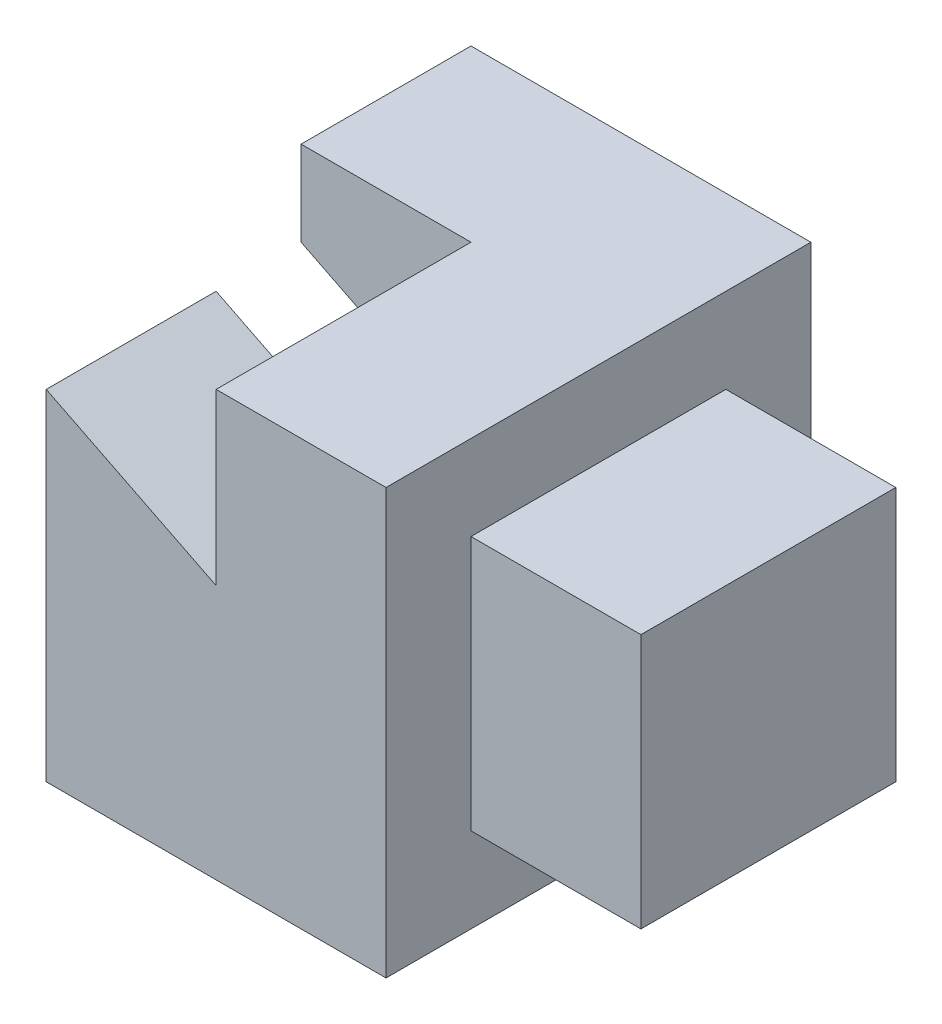
ISO-10303-21;
HEADER;
FILE_DESCRIPTION(('STEP AP214'),'2;1');
FILE_NAME('part.step','',(''),(''),'','','');
FILE_SCHEMA(('AUTOMOTIVE_DESIGN { 1 0 10303 214 1 1 1 1 }'));
ENDSEC;
DATA;
#1=APPLICATION_CONTEXT('core data for automotive mechanical design processes');
#2=APPLICATION_PROTOCOL_DEFINITION('international standard','automotive_design',2000,#1);
#3=PRODUCT_CONTEXT('',#1,'mechanical');
#4=PRODUCT('Part','Part','',(#3));
#5=PRODUCT_RELATED_PRODUCT_CATEGORY('part','',(#4));
#6=PRODUCT_DEFINITION_FORMATION('','',#4);
#7=PRODUCT_DEFINITION_CONTEXT('part definition',#1,'design');
#8=PRODUCT_DEFINITION('design','',#6,#7);
#9=PRODUCT_DEFINITION_SHAPE('','',#8);
#10=(LENGTH_UNIT() NAMED_UNIT(*) SI_UNIT(.MILLI.,.METRE.));
#11=(NAMED_UNIT(*) PLANE_ANGLE_UNIT() SI_UNIT($,.RADIAN.));
#12=(NAMED_UNIT(*) SI_UNIT($,.STERADIAN.) SOLID_ANGLE_UNIT());
#13=UNCERTAINTY_MEASURE_WITH_UNIT(LENGTH_MEASURE(1.E-05),#10,'distance_accuracy_value','');
#14=(GEOMETRIC_REPRESENTATION_CONTEXT(3) GLOBAL_UNCERTAINTY_ASSIGNED_CONTEXT((#13)) GLOBAL_UNIT_ASSIGNED_CONTEXT((#10,
#11,#12)) REPRESENTATION_CONTEXT('',''));
#15=CARTESIAN_POINT('',(0.,0.,0.));
#16=DIRECTION('',(0.,0.,1.));
#17=DIRECTION('',(1.,0.,0.));
#18=AXIS2_PLACEMENT_3D('',#15,#16,#17);
#19=CARTESIAN_POINT('',(2.,-1.5,-1.5));
#20=DIRECTION('',(0.,0.,1.));
#21=DIRECTION('',(1.,0.,0.));
#22=AXIS2_PLACEMENT_3D('',#19,#20,#21);
#23=PLANE('',#22);
#24=DIRECTION('',(0.,1.,0.));
#25=VECTOR('',#24,1.);
#26=CARTESIAN_POINT('',(0.,-1.5,-1.5));
#27=LINE('',#26,#25);
#28=CARTESIAN_POINT('',(0.,-1.5,-1.5));
#29=VERTEX_POINT('',#28);
#30=CARTESIAN_POINT('',(0.,1.5,-1.5));
#31=VERTEX_POINT('',#30);
#32=EDGE_CURVE('E236',#29,#31,#27,.T.);
#33=ORIENTED_EDGE('',*,*,#32,.T.);
#34=DIRECTION('',(-1.,0.,0.));
#35=VECTOR('',#34,1.);
#36=CARTESIAN_POINT('',(2.,1.5,-1.5));
#37=LINE('',#36,#35);
#38=CARTESIAN_POINT('',(2.,1.5,-1.5));
#39=VERTEX_POINT('',#38);
#40=EDGE_CURVE('E11',#39,#31,#37,.T.);
#41=ORIENTED_EDGE('',*,*,#40,.F.);
#42=DIRECTION('',(0.,1.,0.));
#43=VECTOR('',#42,1.);
#44=CARTESIAN_POINT('',(2.,-1.5,-1.5));
#45=LINE('',#44,#43);
#46=CARTESIAN_POINT('',(2.,-1.5,-1.5));
#47=VERTEX_POINT('',#46);
#48=EDGE_CURVE('E237',#47,#39,#45,.T.);
#49=ORIENTED_EDGE('',*,*,#48,.F.);
#50=DIRECTION('',(-1.,0.,0.));
#51=VECTOR('',#50,1.);
#52=CARTESIAN_POINT('',(2.,-1.5,-1.5));
#53=LINE('',#52,#51);
#54=EDGE_CURVE('E247',#47,#29,#53,.T.);
#55=ORIENTED_EDGE('',*,*,#54,.T.);
#56=EDGE_LOOP('',(#33,#41,#49,#55));
#57=FACE_BOUND('',#56,.T.);
#58=ADVANCED_FACE('F33',(#57),#23,.F.);
#59=CARTESIAN_POINT('',(2.,1.5,1.5));
#60=DIRECTION('',(0.,-1.,0.));
#61=DIRECTION('',(0.,0.,-1.));
#62=AXIS2_PLACEMENT_3D('',#59,#60,#61);
#63=PLANE('',#62);
#64=DIRECTION('',(0.,0.,1.));
#65=VECTOR('',#64,1.);
#66=CARTESIAN_POINT('',(0.,1.5,1.5));
#67=LINE('',#66,#65);
#68=CARTESIAN_POINT('',(0.,1.5,1.5));
#69=VERTEX_POINT('',#68);
#70=EDGE_CURVE('E250',#31,#69,#67,.T.);
#71=ORIENTED_EDGE('',*,*,#70,.T.);
#72=DIRECTION('',(-1.,0.,0.));
#73=VECTOR('',#72,1.);
#74=CARTESIAN_POINT('',(2.,1.5,1.5));
#75=LINE('',#74,#73);
#76=CARTESIAN_POINT('',(2.,1.5,1.5));
#77=VERTEX_POINT('',#76);
#78=EDGE_CURVE('E41',#77,#69,#75,.T.);
#79=ORIENTED_EDGE('',*,*,#78,.F.);
#80=DIRECTION('',(0.,0.,1.));
#81=VECTOR('',#80,1.);
#82=CARTESIAN_POINT('',(2.,1.5,1.5));
#83=LINE('',#82,#81);
#84=EDGE_CURVE('E240',#39,#77,#83,.T.);
#85=ORIENTED_EDGE('',*,*,#84,.F.);
#86=ORIENTED_EDGE('',*,*,#40,.T.);
#87=EDGE_LOOP('',(#71,#79,#85,#86));
#88=FACE_BOUND('',#87,.T.);
#89=ADVANCED_FACE('F270',(#88),#63,.F.);
#90=CARTESIAN_POINT('',(2.,-1.5,1.5));
#91=DIRECTION('',(0.,0.,-1.));
#92=DIRECTION('',(-1.,0.,0.));
#93=AXIS2_PLACEMENT_3D('',#90,#91,#92);
#94=PLANE('',#93);
#95=DIRECTION('',(0.,-1.,0.));
#96=VECTOR('',#95,1.);
#97=CARTESIAN_POINT('',(0.,-1.5,1.5));
#98=LINE('',#97,#96);
#99=CARTESIAN_POINT('',(0.,-1.5,1.5));
#100=VERTEX_POINT('',#99);
#101=EDGE_CURVE('E253',#69,#100,#98,.T.);
#102=ORIENTED_EDGE('',*,*,#101,.T.);
#103=DIRECTION('',(-1.,0.,0.));
#104=VECTOR('',#103,1.);
#105=CARTESIAN_POINT('',(2.,-1.5,1.5));
#106=LINE('',#105,#104);
#107=CARTESIAN_POINT('',(2.,-1.5,1.5));
#108=VERTEX_POINT('',#107);
#109=EDGE_CURVE('E260',#108,#100,#106,.T.);
#110=ORIENTED_EDGE('',*,*,#109,.F.);
#111=DIRECTION('',(0.,-1.,0.));
#112=VECTOR('',#111,1.);
#113=CARTESIAN_POINT('',(2.,-1.5,1.5));
#114=LINE('',#113,#112);
#115=EDGE_CURVE('E243',#77,#108,#114,.T.);
#116=ORIENTED_EDGE('',*,*,#115,.F.);
#117=ORIENTED_EDGE('',*,*,#78,.T.);
#118=EDGE_LOOP('',(#102,#110,#116,#117));
#119=FACE_BOUND('',#118,.T.);
#120=ADVANCED_FACE('F267',(#119),#94,.F.);
#121=CARTESIAN_POINT('',(2.,-1.5,1.5));
#122=DIRECTION('',(0.,1.,0.));
#123=DIRECTION('',(0.,0.,1.));
#124=AXIS2_PLACEMENT_3D('',#121,#122,#123);
#125=PLANE('',#124);
#126=DIRECTION('',(0.,0.,-1.));
#127=VECTOR('',#126,1.);
#128=CARTESIAN_POINT('',(0.,-1.5,1.5));
#129=LINE('',#128,#127);
#130=EDGE_CURVE('E241',#100,#29,#129,.T.);
#131=ORIENTED_EDGE('',*,*,#130,.T.);
#132=ORIENTED_EDGE('',*,*,#54,.F.);
#133=DIRECTION('',(0.,0.,-1.));
#134=VECTOR('',#133,1.);
#135=CARTESIAN_POINT('',(2.,-1.5,1.5));
#136=LINE('',#135,#134);
#137=EDGE_CURVE('E245',#108,#47,#136,.T.);
#138=ORIENTED_EDGE('',*,*,#137,.F.);
#139=ORIENTED_EDGE('',*,*,#109,.T.);
#140=EDGE_LOOP('',(#131,#132,#138,#139));
#141=FACE_BOUND('',#140,.T.);
#142=ADVANCED_FACE('F276',(#141),#125,.F.);
#143=CARTESIAN_POINT('',(2.,0.,0.));
#144=DIRECTION('',(-1.,0.,0.));
#145=DIRECTION('',(0.,0.,1.));
#146=AXIS2_PLACEMENT_3D('',#143,#144,#145);
#147=PLANE('',#146);
#148=ORIENTED_EDGE('',*,*,#48,.T.);
#149=ORIENTED_EDGE('',*,*,#84,.T.);
#150=ORIENTED_EDGE('',*,*,#115,.T.);
#151=ORIENTED_EDGE('',*,*,#137,.T.);
#152=EDGE_LOOP('',(#148,#149,#150,#151));
#153=FACE_BOUND('',#152,.T.);
#154=ADVANCED_FACE('F281',(#153),#147,.F.);
#155=CARTESIAN_POINT('',(0.,0.,0.));
#156=DIRECTION('',(1.,0.,0.));
#157=DIRECTION('',(0.,0.,-1.));
#158=AXIS2_PLACEMENT_3D('',#155,#156,#157);
#159=PLANE('',#158);
#160=DIRECTION('',(0.,1.,0.));
#161=VECTOR('',#160,1.);
#162=CARTESIAN_POINT('',(0.,-2.5,2.5));
#163=LINE('',#162,#161);
#164=CARTESIAN_POINT('',(0.,-2.5,2.5));
#165=VERTEX_POINT('',#164);
#166=CARTESIAN_POINT('',(0.,2.5,2.5));
#167=VERTEX_POINT('',#166);
#168=EDGE_CURVE('E180',#165,#167,#163,.T.);
#169=ORIENTED_EDGE('',*,*,#168,.F.);
#170=DIRECTION('',(0.,0.,1.));
#171=VECTOR('',#170,1.);
#172=CARTESIAN_POINT('',(0.,-2.5,-2.5));
#173=LINE('',#172,#171);
#174=CARTESIAN_POINT('',(0.,-2.5,-2.5));
#175=VERTEX_POINT('',#174);
#176=EDGE_CURVE('E227',#175,#165,#173,.T.);
#177=ORIENTED_EDGE('',*,*,#176,.F.);
#178=DIRECTION('',(0.,-1.,0.));
#179=VECTOR('',#178,1.);
#180=CARTESIAN_POINT('',(0.,-2.5,-2.5));
#181=LINE('',#180,#179);
#182=CARTESIAN_POINT('',(0.,2.5,-2.5));
#183=VERTEX_POINT('',#182);
#184=EDGE_CURVE('E225',#183,#175,#181,.T.);
#185=ORIENTED_EDGE('',*,*,#184,.F.);
#186=DIRECTION('',(0.,0.,-1.));
#187=VECTOR('',#186,1.);
#188=CARTESIAN_POINT('',(0.,2.5,-2.5));
#189=LINE('',#188,#187);
#190=EDGE_CURVE('E223',#167,#183,#189,.T.);
#191=ORIENTED_EDGE('',*,*,#190,.F.);
#192=EDGE_LOOP('',(#169,#177,#185,#191));
#193=FACE_BOUND('',#192,.T.);
#194=ORIENTED_EDGE('',*,*,#32,.F.);
#195=ORIENTED_EDGE('',*,*,#130,.F.);
#196=ORIENTED_EDGE('',*,*,#101,.F.);
#197=ORIENTED_EDGE('',*,*,#70,.F.);
#198=EDGE_LOOP('',(#194,#195,#196,#197));
#199=FACE_BOUND('',#198,.T.);
#200=ADVANCED_FACE('F273',(#193,#199),#159,.T.);
#201=CARTESIAN_POINT('',(-2.,-2.5,2.5));
#202=DIRECTION('',(0.,0.,-1.));
#203=DIRECTION('',(-1.,0.,0.));
#204=AXIS2_PLACEMENT_3D('',#201,#202,#203);
#205=PLANE('',#204);
#206=ORIENTED_EDGE('',*,*,#168,.T.);
#207=DIRECTION('',(1.,0.,0.));
#208=VECTOR('',#207,1.);
#209=CARTESIAN_POINT('',(-2.,2.5,2.5));
#210=LINE('',#209,#208);
#211=CARTESIAN_POINT('',(-2.,2.5,2.5));
#212=VERTEX_POINT('',#211);
#213=EDGE_CURVE('E233',#212,#167,#210,.T.);
#214=ORIENTED_EDGE('',*,*,#213,.F.);
#215=DIRECTION('',(0.,1.,0.));
#216=VECTOR('',#215,1.);
#217=CARTESIAN_POINT('',(-2.,-2.5,2.5));
#218=LINE('',#217,#216);
#219=CARTESIAN_POINT('',(-2.,0.5,2.5));
#220=VERTEX_POINT('',#219);
#221=EDGE_CURVE('E218',#220,#212,#218,.T.);
#222=ORIENTED_EDGE('',*,*,#221,.F.);
#223=DIRECTION('',(-0.894427190999916,0.447213595499958,0.));
#224=VECTOR('',#223,1.);
#225=CARTESIAN_POINT('',(-4.,1.5,2.5));
#226=LINE('',#225,#224);
#227=CARTESIAN_POINT('',(-4.,1.5,2.5));
#228=VERTEX_POINT('',#227);
#229=EDGE_CURVE('E164',#220,#228,#226,.T.);
#230=ORIENTED_EDGE('',*,*,#229,.T.);
#231=DIRECTION('',(0.,-1.,0.));
#232=VECTOR('',#231,1.);
#233=CARTESIAN_POINT('',(-4.,-2.5,2.5));
#234=LINE('',#233,#232);
#235=CARTESIAN_POINT('',(-4.,-2.5,2.5));
#236=VERTEX_POINT('',#235);
#237=EDGE_CURVE('E174',#228,#236,#234,.T.);
#238=ORIENTED_EDGE('',*,*,#237,.T.);
#239=DIRECTION('',(1.,0.,0.));
#240=VECTOR('',#239,1.);
#241=CARTESIAN_POINT('',(-2.,-2.5,2.5));
#242=LINE('',#241,#240);
#243=EDGE_CURVE('E210',#236,#165,#242,.T.);
#244=ORIENTED_EDGE('',*,*,#243,.T.);
#245=EDGE_LOOP('',(#206,#214,#222,#230,#238,#244));
#246=FACE_BOUND('',#245,.T.);
#247=ADVANCED_FACE('F288',(#246),#205,.F.);
#248=CARTESIAN_POINT('',(-2.,2.5,-2.5));
#249=DIRECTION('',(0.,-1.,0.));
#250=DIRECTION('',(0.,0.,-1.));
#251=AXIS2_PLACEMENT_3D('',#248,#249,#250);
#252=PLANE('',#251);
#253=ORIENTED_EDGE('',*,*,#190,.T.);
#254=DIRECTION('',(1.,0.,0.));
#255=VECTOR('',#254,1.);
#256=CARTESIAN_POINT('',(-2.,2.5,-2.5));
#257=LINE('',#256,#255);
#258=CARTESIAN_POINT('',(-4.,2.5,-2.5));
#259=VERTEX_POINT('',#258);
#260=EDGE_CURVE('E230',#259,#183,#257,.T.);
#261=ORIENTED_EDGE('',*,*,#260,.F.);
#262=DIRECTION('',(0.,0.,-1.));
#263=VECTOR('',#262,1.);
#264=CARTESIAN_POINT('',(-4.,2.5,-0.5));
#265=LINE('',#264,#263);
#266=CARTESIAN_POINT('',(-4.,2.5,-0.5));
#267=VERTEX_POINT('',#266);
#268=EDGE_CURVE('E145',#267,#259,#265,.T.);
#269=ORIENTED_EDGE('',*,*,#268,.F.);
#270=DIRECTION('',(1.,0.,0.));
#271=VECTOR('',#270,1.);
#272=CARTESIAN_POINT('',(-4.,2.5,-0.5));
#273=LINE('',#272,#271);
#274=CARTESIAN_POINT('',(-2.,2.5,-0.5));
#275=VERTEX_POINT('',#274);
#276=EDGE_CURVE('E156',#267,#275,#273,.T.);
#277=ORIENTED_EDGE('',*,*,#276,.T.);
#278=DIRECTION('',(0.,0.,-1.));
#279=VECTOR('',#278,1.);
#280=CARTESIAN_POINT('',(-2.,2.5,-2.5));
#281=LINE('',#280,#279);
#282=EDGE_CURVE('E54',#212,#275,#281,.T.);
#283=ORIENTED_EDGE('',*,*,#282,.F.);
#284=ORIENTED_EDGE('',*,*,#213,.T.);
#285=EDGE_LOOP('',(#253,#261,#269,#277,#283,#284));
#286=FACE_BOUND('',#285,.T.);
#287=ADVANCED_FACE('F324',(#286),#252,.F.);
#288=CARTESIAN_POINT('',(-2.,-2.5,-2.5));
#289=DIRECTION('',(0.,0.,1.));
#290=DIRECTION('',(1.,0.,0.));
#291=AXIS2_PLACEMENT_3D('',#288,#289,#290);
#292=PLANE('',#291);
#293=ORIENTED_EDGE('',*,*,#184,.T.);
#294=DIRECTION('',(1.,0.,0.));
#295=VECTOR('',#294,1.);
#296=CARTESIAN_POINT('',(-2.,-2.5,-2.5));
#297=LINE('',#296,#295);
#298=CARTESIAN_POINT('',(-2.,-2.5,-2.5));
#299=VERTEX_POINT('',#298);
#300=EDGE_CURVE('E213',#299,#175,#297,.T.);
#301=ORIENTED_EDGE('',*,*,#300,.F.);
#302=DIRECTION('',(0.,-1.,0.));
#303=VECTOR('',#302,1.);
#304=CARTESIAN_POINT('',(-2.,-2.5,-2.5));
#305=LINE('',#304,#303);
#306=CARTESIAN_POINT('',(-2.,0.5,-2.5));
#307=VERTEX_POINT('',#306);
#308=EDGE_CURVE('E208',#307,#299,#305,.T.);
#309=ORIENTED_EDGE('',*,*,#308,.F.);
#310=DIRECTION('',(-0.894427190999916,0.447213595499958,0.));
#311=VECTOR('',#310,1.);
#312=CARTESIAN_POINT('',(-2.,0.5,-2.5));
#313=LINE('',#312,#311);
#314=CARTESIAN_POINT('',(-4.,1.5,-2.5));
#315=VERTEX_POINT('',#314);
#316=EDGE_CURVE('E161',#307,#315,#313,.T.);
#317=ORIENTED_EDGE('',*,*,#316,.T.);
#318=DIRECTION('',(0.,1.,0.));
#319=VECTOR('',#318,1.);
#320=CARTESIAN_POINT('',(-4.,1.5,-2.5));
#321=LINE('',#320,#319);
#322=EDGE_CURVE('E141',#315,#259,#321,.T.);
#323=ORIENTED_EDGE('',*,*,#322,.T.);
#324=ORIENTED_EDGE('',*,*,#260,.T.);
#325=EDGE_LOOP('',(#293,#301,#309,#317,#323,#324));
#326=FACE_BOUND('',#325,.T.);
#327=ADVANCED_FACE('F335',(#326),#292,.F.);
#328=CARTESIAN_POINT('',(-2.,-2.5,-2.5));
#329=DIRECTION('',(0.,1.,0.));
#330=DIRECTION('',(0.,0.,1.));
#331=AXIS2_PLACEMENT_3D('',#328,#329,#330);
#332=PLANE('',#331);
#333=ORIENTED_EDGE('',*,*,#176,.T.);
#334=ORIENTED_EDGE('',*,*,#243,.F.);
#335=DIRECTION('',(0.,0.,1.));
#336=VECTOR('',#335,1.);
#337=CARTESIAN_POINT('',(-4.,-2.5,0.5));
#338=LINE('',#337,#336);
#339=CARTESIAN_POINT('',(-4.,-2.5,0.5));
#340=VERTEX_POINT('',#339);
#341=EDGE_CURVE('E177',#340,#236,#338,.T.);
#342=ORIENTED_EDGE('',*,*,#341,.F.);
#343=DIRECTION('',(1.,0.,0.));
#344=VECTOR('',#343,1.);
#345=CARTESIAN_POINT('',(-2.,-2.5,0.5));
#346=LINE('',#345,#344);
#347=CARTESIAN_POINT('',(-2.,-2.5,0.5));
#348=VERTEX_POINT('',#347);
#349=EDGE_CURVE('E173',#340,#348,#346,.T.);
#350=ORIENTED_EDGE('',*,*,#349,.T.);
#351=DIRECTION('',(0.,0.,1.));
#352=VECTOR('',#351,1.);
#353=CARTESIAN_POINT('',(-2.,-2.5,-2.5));
#354=LINE('',#353,#352);
#355=EDGE_CURVE('E204',#299,#348,#354,.T.);
#356=ORIENTED_EDGE('',*,*,#355,.F.);
#357=ORIENTED_EDGE('',*,*,#300,.T.);
#358=EDGE_LOOP('',(#333,#334,#342,#350,#356,#357));
#359=FACE_BOUND('',#358,.T.);
#360=ADVANCED_FACE('F202',(#359),#332,.F.);
#361=CARTESIAN_POINT('',(-2.,0.,0.));
#362=DIRECTION('',(1.,0.,0.));
#363=DIRECTION('',(0.,0.,-1.));
#364=AXIS2_PLACEMENT_3D('',#361,#362,#363);
#365=PLANE('',#364);
#366=DIRECTION('',(0.,-1.,0.));
#367=VECTOR('',#366,1.);
#368=CARTESIAN_POINT('',(-2.,2.5,-0.5));
#369=LINE('',#368,#367);
#370=CARTESIAN_POINT('',(-2.,0.5,-0.5));
#371=VERTEX_POINT('',#370);
#372=EDGE_CURVE('E49',#275,#371,#369,.T.);
#373=ORIENTED_EDGE('',*,*,#372,.T.);
#374=DIRECTION('',(0.,0.,-1.));
#375=VECTOR('',#374,1.);
#376=CARTESIAN_POINT('',(-2.,0.5,-0.5));
#377=LINE('',#376,#375);
#378=EDGE_CURVE('E146',#371,#307,#377,.T.);
#379=ORIENTED_EDGE('',*,*,#378,.T.);
#380=ORIENTED_EDGE('',*,*,#308,.T.);
#381=ORIENTED_EDGE('',*,*,#355,.T.);
#382=DIRECTION('',(0.,1.,0.));
#383=VECTOR('',#382,1.);
#384=CARTESIAN_POINT('',(-2.,0.5,0.5));
#385=LINE('',#384,#383);
#386=CARTESIAN_POINT('',(-2.,0.5,0.5));
#387=VERTEX_POINT('',#386);
#388=EDGE_CURVE('E170',#348,#387,#385,.T.);
#389=ORIENTED_EDGE('',*,*,#388,.T.);
#390=DIRECTION('',(0.,0.,1.));
#391=VECTOR('',#390,1.);
#392=CARTESIAN_POINT('',(-2.,0.5,0.5));
#393=LINE('',#392,#391);
#394=EDGE_CURVE('E183',#387,#220,#393,.T.);
#395=ORIENTED_EDGE('',*,*,#394,.T.);
#396=ORIENTED_EDGE('',*,*,#221,.T.);
#397=ORIENTED_EDGE('',*,*,#282,.T.);
#398=EDGE_LOOP('',(#373,#379,#380,#381,#389,#395,#396,#397));
#399=FACE_BOUND('',#398,.T.);
#400=ADVANCED_FACE('F207',(#399),#365,.F.);
#401=CARTESIAN_POINT('',(-4.,-2.5,0.5));
#402=DIRECTION('',(-1.,0.,0.));
#403=DIRECTION('',(0.,0.,1.));
#404=AXIS2_PLACEMENT_3D('',#401,#402,#403);
#405=PLANE('',#404);
#406=ORIENTED_EDGE('',*,*,#237,.F.);
#407=DIRECTION('',(0.,0.,1.));
#408=VECTOR('',#407,1.);
#409=CARTESIAN_POINT('',(-4.,1.5,0.5));
#410=LINE('',#409,#408);
#411=CARTESIAN_POINT('',(-4.,1.5,0.5));
#412=VERTEX_POINT('',#411);
#413=EDGE_CURVE('E181',#412,#228,#410,.T.);
#414=ORIENTED_EDGE('',*,*,#413,.F.);
#415=DIRECTION('',(0.,-1.,0.));
#416=VECTOR('',#415,1.);
#417=CARTESIAN_POINT('',(-4.,-2.5,0.5));
#418=LINE('',#417,#416);
#419=EDGE_CURVE('E169',#412,#340,#418,.T.);
#420=ORIENTED_EDGE('',*,*,#419,.T.);
#421=ORIENTED_EDGE('',*,*,#341,.T.);
#422=EDGE_LOOP('',(#406,#414,#420,#421));
#423=FACE_BOUND('',#422,.T.);
#424=ADVANCED_FACE('F344',(#423),#405,.T.);
#425=CARTESIAN_POINT('',(-4.,1.5,0.5));
#426=DIRECTION('',(0.447213595499958,0.894427190999916,0.));
#427=DIRECTION('',(-0.894427190999916,0.447213595499958,0.));
#428=AXIS2_PLACEMENT_3D('',#425,#426,#427);
#429=PLANE('',#428);
#430=ORIENTED_EDGE('',*,*,#229,.F.);
#431=ORIENTED_EDGE('',*,*,#394,.F.);
#432=DIRECTION('',(-0.894427190999916,0.447213595499958,0.));
#433=VECTOR('',#432,1.);
#434=CARTESIAN_POINT('',(-4.,1.5,0.5));
#435=LINE('',#434,#433);
#436=EDGE_CURVE('E166',#387,#412,#435,.T.);
#437=ORIENTED_EDGE('',*,*,#436,.T.);
#438=ORIENTED_EDGE('',*,*,#413,.T.);
#439=EDGE_LOOP('',(#430,#431,#437,#438));
#440=FACE_BOUND('',#439,.T.);
#441=ADVANCED_FACE('F348',(#440),#429,.T.);
#442=CARTESIAN_POINT('',(0.,0.,0.5));
#443=DIRECTION('',(0.,0.,-1.));
#444=DIRECTION('',(-1.,0.,0.));
#445=AXIS2_PLACEMENT_3D('',#442,#443,#444);
#446=PLANE('',#445);
#447=ORIENTED_EDGE('',*,*,#388,.F.);
#448=ORIENTED_EDGE('',*,*,#349,.F.);
#449=ORIENTED_EDGE('',*,*,#419,.F.);
#450=ORIENTED_EDGE('',*,*,#436,.F.);
#451=EDGE_LOOP('',(#447,#448,#449,#450));
#452=FACE_BOUND('',#451,.T.);
#453=ADVANCED_FACE('F358',(#452),#446,.T.);
#454=CARTESIAN_POINT('',(-4.,1.5,-0.5));
#455=DIRECTION('',(-1.,0.,0.));
#456=DIRECTION('',(0.,0.,1.));
#457=AXIS2_PLACEMENT_3D('',#454,#455,#456);
#458=PLANE('',#457);
#459=ORIENTED_EDGE('',*,*,#322,.F.);
#460=DIRECTION('',(0.,0.,-1.));
#461=VECTOR('',#460,1.);
#462=CARTESIAN_POINT('',(-4.,1.5,-0.5));
#463=LINE('',#462,#461);
#464=CARTESIAN_POINT('',(-4.,1.5,-0.5));
#465=VERTEX_POINT('',#464);
#466=EDGE_CURVE('E134',#465,#315,#463,.T.);
#467=ORIENTED_EDGE('',*,*,#466,.F.);
#468=DIRECTION('',(0.,1.,0.));
#469=VECTOR('',#468,1.);
#470=CARTESIAN_POINT('',(-4.,1.5,-0.5));
#471=LINE('',#470,#469);
#472=EDGE_CURVE('E139',#465,#267,#471,.T.);
#473=ORIENTED_EDGE('',*,*,#472,.T.);
#474=ORIENTED_EDGE('',*,*,#268,.T.);
#475=EDGE_LOOP('',(#459,#467,#473,#474));
#476=FACE_BOUND('',#475,.T.);
#477=ADVANCED_FACE('F136',(#476),#458,.T.);
#478=CARTESIAN_POINT('',(-2.,0.5,-0.5));
#479=DIRECTION('',(-0.447213595499958,-0.894427190999916,0.));
#480=DIRECTION('',(0.894427190999916,-0.447213595499958,0.));
#481=AXIS2_PLACEMENT_3D('',#478,#479,#480);
#482=PLANE('',#481);
#483=ORIENTED_EDGE('',*,*,#316,.F.);
#484=ORIENTED_EDGE('',*,*,#378,.F.);
#485=DIRECTION('',(-0.894427190999916,0.447213595499958,0.));
#486=VECTOR('',#485,1.);
#487=CARTESIAN_POINT('',(-2.,0.5,-0.5));
#488=LINE('',#487,#486);
#489=EDGE_CURVE('E149',#371,#465,#488,.T.);
#490=ORIENTED_EDGE('',*,*,#489,.T.);
#491=ORIENTED_EDGE('',*,*,#466,.T.);
#492=EDGE_LOOP('',(#483,#484,#490,#491));
#493=FACE_BOUND('',#492,.T.);
#494=ADVANCED_FACE('F150',(#493),#482,.T.);
#495=CARTESIAN_POINT('',(0.,0.,-0.5));
#496=DIRECTION('',(0.,0.,-1.));
#497=DIRECTION('',(-1.,0.,0.));
#498=AXIS2_PLACEMENT_3D('',#495,#496,#497);
#499=PLANE('',#498);
#500=ORIENTED_EDGE('',*,*,#276,.F.);
#501=ORIENTED_EDGE('',*,*,#472,.F.);
#502=ORIENTED_EDGE('',*,*,#489,.F.);
#503=ORIENTED_EDGE('',*,*,#372,.F.);
#504=EDGE_LOOP('',(#500,#501,#502,#503));
#505=FACE_BOUND('',#504,.T.);
#506=ADVANCED_FACE('F154',(#505),#499,.F.);
#507=CLOSED_SHELL('',(#58,#89,#120,#142,#154,#200,#247,#287,#327,#360,#400,#424,#441,#453,#477,
#494,#506));
#508=MANIFOLD_SOLID_BREP('B2',#507);
#509=ADVANCED_BREP_SHAPE_REPRESENTATION('',(#18,#508),#14);
#510=SHAPE_DEFINITION_REPRESENTATION(#9,#509);
ENDSEC;
END-ISO-10303-21;
